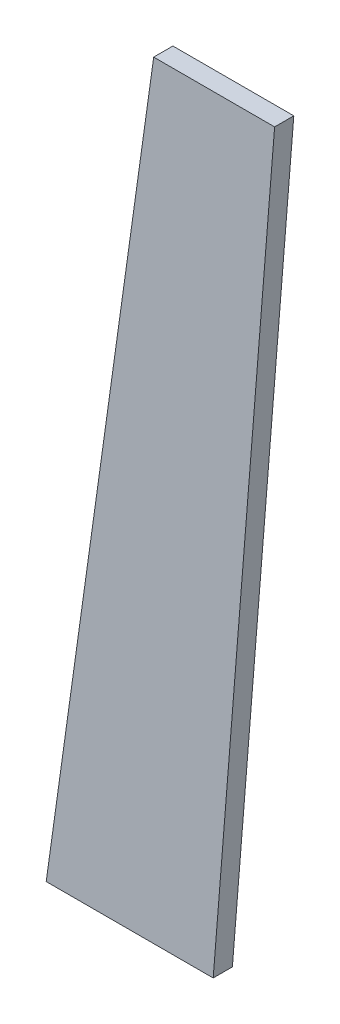
ISO-10303-21;
HEADER;
FILE_DESCRIPTION(('STEP AP214'),'2;1');
FILE_NAME('part.step','',(''),(''),'','','');
FILE_SCHEMA(('AUTOMOTIVE_DESIGN { 1 0 10303 214 1 1 1 1 }'));
ENDSEC;
DATA;
#1=APPLICATION_CONTEXT('core data for automotive mechanical design processes');
#2=APPLICATION_PROTOCOL_DEFINITION('international standard','automotive_design',2000,#1);
#3=PRODUCT_CONTEXT('',#1,'mechanical');
#4=PRODUCT('Part','Part','',(#3));
#5=PRODUCT_RELATED_PRODUCT_CATEGORY('part','',(#4));
#6=PRODUCT_DEFINITION_FORMATION('','',#4);
#7=PRODUCT_DEFINITION_CONTEXT('part definition',#1,'design');
#8=PRODUCT_DEFINITION('design','',#6,#7);
#9=PRODUCT_DEFINITION_SHAPE('','',#8);
#10=(LENGTH_UNIT() NAMED_UNIT(*) SI_UNIT(.MILLI.,.METRE.));
#11=(NAMED_UNIT(*) PLANE_ANGLE_UNIT() SI_UNIT($,.RADIAN.));
#12=(NAMED_UNIT(*) SI_UNIT($,.STERADIAN.) SOLID_ANGLE_UNIT());
#13=UNCERTAINTY_MEASURE_WITH_UNIT(LENGTH_MEASURE(1.E-05),#10,'distance_accuracy_value','');
#14=(GEOMETRIC_REPRESENTATION_CONTEXT(3) GLOBAL_UNCERTAINTY_ASSIGNED_CONTEXT((#13)) GLOBAL_UNIT_ASSIGNED_CONTEXT((#10,
#11,#12)) REPRESENTATION_CONTEXT('',''));
#15=CARTESIAN_POINT('',(0.,0.,0.));
#16=DIRECTION('',(0.,0.,1.));
#17=DIRECTION('',(1.,0.,0.));
#18=AXIS2_PLACEMENT_3D('',#15,#16,#17);
#19=CARTESIAN_POINT('',(81.5169748002171,225.,5.));
#20=DIRECTION('',(-0.996815278536125,0.0797452222828901,0.));
#21=DIRECTION('',(-0.0797452222828901,-0.996815278536125,0.));
#22=AXIS2_PLACEMENT_3D('',#19,#20,#21);
#23=PLANE('',#22);
#24=DIRECTION('',(0.0797452222828901,0.996815278536125,0.));
#25=VECTOR('',#24,1.);
#26=CARTESIAN_POINT('',(81.5169748002171,225.,0.));
#27=LINE('',#26,#25);
#28=CARTESIAN_POINT('',(65.5169748002171,25.,0.));
#29=VERTEX_POINT('',#28);
#30=CARTESIAN_POINT('',(81.5169748002171,225.,0.));
#31=VERTEX_POINT('',#30);
#32=EDGE_CURVE('E99',#29,#31,#27,.T.);
#33=ORIENTED_EDGE('',*,*,#32,.T.);
#34=DIRECTION('',(0.,0.,-1.));
#35=VECTOR('',#34,1.);
#36=CARTESIAN_POINT('',(81.5169748002171,225.,5.));
#37=LINE('',#36,#35);
#38=CARTESIAN_POINT('',(81.5169748002171,225.,5.));
#39=VERTEX_POINT('',#38);
#40=EDGE_CURVE('E11',#39,#31,#37,.T.);
#41=ORIENTED_EDGE('',*,*,#40,.F.);
#42=DIRECTION('',(0.0797452222828901,0.996815278536125,0.));
#43=VECTOR('',#42,1.);
#44=CARTESIAN_POINT('',(81.5169748002171,225.,5.));
#45=LINE('',#44,#43);
#46=CARTESIAN_POINT('',(65.5169748002171,25.,5.));
#47=VERTEX_POINT('',#46);
#48=EDGE_CURVE('E87',#47,#39,#45,.T.);
#49=ORIENTED_EDGE('',*,*,#48,.F.);
#50=DIRECTION('',(0.,0.,-1.));
#51=VECTOR('',#50,1.);
#52=CARTESIAN_POINT('',(65.5169748002171,25.,5.));
#53=LINE('',#52,#51);
#54=EDGE_CURVE('E95',#47,#29,#53,.T.);
#55=ORIENTED_EDGE('',*,*,#54,.T.);
#56=EDGE_LOOP('',(#33,#41,#49,#55));
#57=FACE_BOUND('',#56,.T.);
#58=ADVANCED_FACE('F36',(#57),#23,.F.);
#59=CARTESIAN_POINT('',(50.0169748002171,225.,5.));
#60=DIRECTION('',(0.,-1.,0.));
#61=DIRECTION('',(1.,0.,0.));
#62=AXIS2_PLACEMENT_3D('',#59,#60,#61);
#63=PLANE('',#62);
#64=DIRECTION('',(-1.,0.,0.));
#65=VECTOR('',#64,1.);
#66=CARTESIAN_POINT('',(50.0169748002171,225.,0.));
#67=LINE('',#66,#65);
#68=CARTESIAN_POINT('',(50.0169748002171,225.,0.));
#69=VERTEX_POINT('',#68);
#70=EDGE_CURVE('E91',#31,#69,#67,.T.);
#71=ORIENTED_EDGE('',*,*,#70,.T.);
#72=DIRECTION('',(0.,0.,-1.));
#73=VECTOR('',#72,1.);
#74=CARTESIAN_POINT('',(50.0169748002171,225.,5.));
#75=LINE('',#74,#73);
#76=CARTESIAN_POINT('',(50.0169748002171,225.,5.));
#77=VERTEX_POINT('',#76);
#78=EDGE_CURVE('E44',#77,#69,#75,.T.);
#79=ORIENTED_EDGE('',*,*,#78,.F.);
#80=DIRECTION('',(-1.,0.,0.));
#81=VECTOR('',#80,1.);
#82=CARTESIAN_POINT('',(50.0169748002171,225.,5.));
#83=LINE('',#82,#81);
#84=EDGE_CURVE('E82',#39,#77,#83,.T.);
#85=ORIENTED_EDGE('',*,*,#84,.F.);
#86=ORIENTED_EDGE('',*,*,#40,.T.);
#87=EDGE_LOOP('',(#71,#79,#85,#86));
#88=FACE_BOUND('',#87,.T.);
#89=ADVANCED_FACE('F90',(#88),#63,.F.);
#90=CARTESIAN_POINT('',(22.0169748002171,25.,5.));
#91=DIRECTION('',(0.99034174667433,-0.138647844534406,0.));
#92=DIRECTION('',(0.138647844534406,0.99034174667433,0.));
#93=AXIS2_PLACEMENT_3D('',#90,#91,#92);
#94=PLANE('',#93);
#95=DIRECTION('',(-0.138647844534406,-0.99034174667433,0.));
#96=VECTOR('',#95,1.);
#97=CARTESIAN_POINT('',(22.0169748002171,25.,0.));
#98=LINE('',#97,#96);
#99=CARTESIAN_POINT('',(22.0169748002171,25.,0.));
#100=VERTEX_POINT('',#99);
#101=EDGE_CURVE('E69',#69,#100,#98,.T.);
#102=ORIENTED_EDGE('',*,*,#101,.T.);
#103=DIRECTION('',(0.,0.,-1.));
#104=VECTOR('',#103,1.);
#105=CARTESIAN_POINT('',(22.0169748002171,25.,5.));
#106=LINE('',#105,#104);
#107=CARTESIAN_POINT('',(22.0169748002171,25.,5.));
#108=VERTEX_POINT('',#107);
#109=EDGE_CURVE('E92',#108,#100,#106,.T.);
#110=ORIENTED_EDGE('',*,*,#109,.F.);
#111=DIRECTION('',(-0.138647844534406,-0.99034174667433,0.));
#112=VECTOR('',#111,1.);
#113=CARTESIAN_POINT('',(22.0169748002171,25.,5.));
#114=LINE('',#113,#112);
#115=EDGE_CURVE('E85',#77,#108,#114,.T.);
#116=ORIENTED_EDGE('',*,*,#115,.F.);
#117=ORIENTED_EDGE('',*,*,#78,.T.);
#118=EDGE_LOOP('',(#102,#110,#116,#117));
#119=FACE_BOUND('',#118,.T.);
#120=ADVANCED_FACE('F93',(#119),#94,.F.);
#121=CARTESIAN_POINT('',(65.5169748002171,25.,5.));
#122=DIRECTION('',(0.,1.,0.));
#123=DIRECTION('',(-1.,0.,0.));
#124=AXIS2_PLACEMENT_3D('',#121,#122,#123);
#125=PLANE('',#124);
#126=DIRECTION('',(1.,0.,0.));
#127=VECTOR('',#126,1.);
#128=CARTESIAN_POINT('',(65.5169748002171,25.,0.));
#129=LINE('',#128,#127);
#130=EDGE_CURVE('E75',#100,#29,#129,.T.);
#131=ORIENTED_EDGE('',*,*,#130,.T.);
#132=ORIENTED_EDGE('',*,*,#54,.F.);
#133=DIRECTION('',(1.,0.,0.));
#134=VECTOR('',#133,1.);
#135=CARTESIAN_POINT('',(65.5169748002171,25.,5.));
#136=LINE('',#135,#134);
#137=EDGE_CURVE('E52',#108,#47,#136,.T.);
#138=ORIENTED_EDGE('',*,*,#137,.F.);
#139=ORIENTED_EDGE('',*,*,#109,.T.);
#140=EDGE_LOOP('',(#131,#132,#138,#139));
#141=FACE_BOUND('',#140,.T.);
#142=ADVANCED_FACE('F106',(#141),#125,.F.);
#143=CARTESIAN_POINT('',(0.,0.,5.));
#144=DIRECTION('',(0.,0.,-1.));
#145=DIRECTION('',(-1.,0.,0.));
#146=AXIS2_PLACEMENT_3D('',#143,#144,#145);
#147=PLANE('',#146);
#148=ORIENTED_EDGE('',*,*,#48,.T.);
#149=ORIENTED_EDGE('',*,*,#84,.T.);
#150=ORIENTED_EDGE('',*,*,#115,.T.);
#151=ORIENTED_EDGE('',*,*,#137,.T.);
#152=EDGE_LOOP('',(#148,#149,#150,#151));
#153=FACE_BOUND('',#152,.T.);
#154=ADVANCED_FACE('F83',(#153),#147,.F.);
#155=CARTESIAN_POINT('',(0.,0.,0.));
#156=DIRECTION('',(0.,0.,-1.));
#157=DIRECTION('',(-1.,0.,0.));
#158=AXIS2_PLACEMENT_3D('',#155,#156,#157);
#159=PLANE('',#158);
#160=ORIENTED_EDGE('',*,*,#32,.F.);
#161=ORIENTED_EDGE('',*,*,#130,.F.);
#162=ORIENTED_EDGE('',*,*,#101,.F.);
#163=ORIENTED_EDGE('',*,*,#70,.F.);
#164=EDGE_LOOP('',(#160,#161,#162,#163));
#165=FACE_BOUND('',#164,.T.);
#166=ADVANCED_FACE('F109',(#165),#159,.T.);
#167=CLOSED_SHELL('',(#58,#89,#120,#142,#154,#166));
#168=MANIFOLD_SOLID_BREP('B2',#167);
#169=ADVANCED_BREP_SHAPE_REPRESENTATION('',(#18,#168),#14);
#170=SHAPE_DEFINITION_REPRESENTATION(#9,#169);
ENDSEC;
END-ISO-10303-21;
